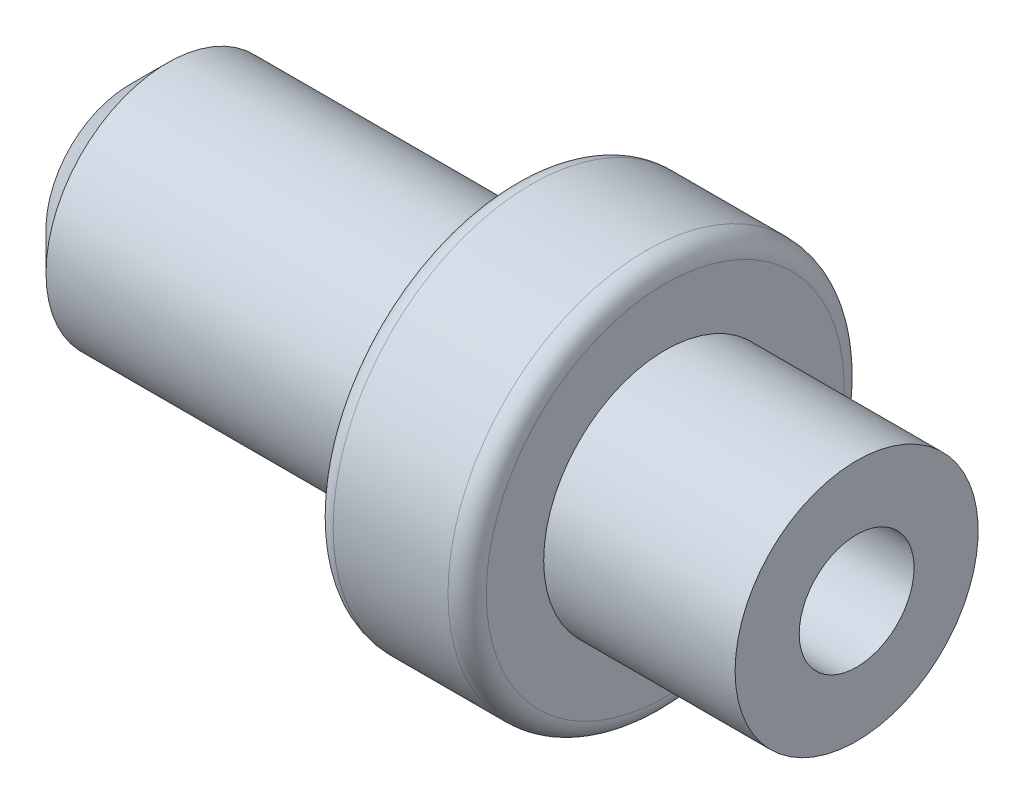
ISO-10303-21;
HEADER;
FILE_DESCRIPTION(('STEP AP214'),'2;1');
FILE_NAME('part.step','',(''),(''),'','','');
FILE_SCHEMA(('AUTOMOTIVE_DESIGN { 1 0 10303 214 1 1 1 1 }'));
ENDSEC;
DATA;
#1=APPLICATION_CONTEXT('core data for automotive mechanical design processes');
#2=APPLICATION_PROTOCOL_DEFINITION('international standard','automotive_design',2000,#1);
#3=PRODUCT_CONTEXT('',#1,'mechanical');
#4=PRODUCT('Part','Part','',(#3));
#5=PRODUCT_RELATED_PRODUCT_CATEGORY('part','',(#4));
#6=PRODUCT_DEFINITION_FORMATION('','',#4);
#7=PRODUCT_DEFINITION_CONTEXT('part definition',#1,'design');
#8=PRODUCT_DEFINITION('design','',#6,#7);
#9=PRODUCT_DEFINITION_SHAPE('','',#8);
#10=(LENGTH_UNIT() NAMED_UNIT(*) SI_UNIT(.MILLI.,.METRE.));
#11=(NAMED_UNIT(*) PLANE_ANGLE_UNIT() SI_UNIT($,.RADIAN.));
#12=(NAMED_UNIT(*) SI_UNIT($,.STERADIAN.) SOLID_ANGLE_UNIT());
#13=UNCERTAINTY_MEASURE_WITH_UNIT(LENGTH_MEASURE(1.E-05),#10,'distance_accuracy_value','');
#14=(GEOMETRIC_REPRESENTATION_CONTEXT(3) GLOBAL_UNCERTAINTY_ASSIGNED_CONTEXT((#13)) GLOBAL_UNIT_ASSIGNED_CONTEXT((#10,
#11,#12)) REPRESENTATION_CONTEXT('',''));
#15=CARTESIAN_POINT('',(0.,0.,0.));
#16=DIRECTION('',(0.,0.,1.));
#17=DIRECTION('',(1.,0.,0.));
#18=AXIS2_PLACEMENT_3D('',#15,#16,#17);
#19=CARTESIAN_POINT('',(-34.8243596228253,0.,0.));
#20=DIRECTION('',(-1.,0.,0.));
#21=DIRECTION('',(0.,0.,1.));
#22=AXIS2_PLACEMENT_3D('',#19,#20,#21);
#23=CYLINDRICAL_SURFACE('',#22,3.175);
#24=CARTESIAN_POINT('',(-8.99999999999999,0.,0.));
#25=DIRECTION('',(1.,0.,0.));
#26=DIRECTION('',(0.,0.,-1.));
#27=AXIS2_PLACEMENT_3D('',#24,#25,#26);
#28=CIRCLE('',#27,3.175);
#29=CARTESIAN_POINT('',(-8.99999999999999,0.,-3.175));
#30=VERTEX_POINT('',#29);
#31=EDGE_CURVE('E49',#30,#30,#28,.T.);
#32=ORIENTED_EDGE('',*,*,#31,.T.);
#33=EDGE_LOOP('',(#32));
#34=FACE_BOUND('',#33,.T.);
#35=CARTESIAN_POINT('',(0.,0.,0.));
#36=DIRECTION('',(-1.,0.,0.));
#37=DIRECTION('',(0.,0.,1.));
#38=AXIS2_PLACEMENT_3D('',#35,#36,#37);
#39=CIRCLE('',#38,3.175);
#40=CARTESIAN_POINT('',(0.,0.,3.175));
#41=VERTEX_POINT('',#40);
#42=EDGE_CURVE('E67',#41,#41,#39,.T.);
#43=ORIENTED_EDGE('',*,*,#42,.T.);
#44=EDGE_LOOP('',(#43));
#45=FACE_BOUND('',#44,.T.);
#46=ADVANCED_FACE('F29',(#34,#45),#23,.T.);
#47=CARTESIAN_POINT('',(-10.,1.5,0.));
#48=DIRECTION('',(1.,0.,0.));
#49=DIRECTION('',(0.,0.,-1.));
#50=AXIS2_PLACEMENT_3D('',#47,#48,#49);
#51=PLANE('',#50);
#52=CARTESIAN_POINT('',(-10.,0.,0.));
#53=DIRECTION('',(1.,0.,0.));
#54=DIRECTION('',(0.,0.,-1.));
#55=AXIS2_PLACEMENT_3D('',#52,#53,#54);
#56=CIRCLE('',#55,2.175);
#57=CARTESIAN_POINT('',(-10.,0.,-2.175));
#58=VERTEX_POINT('',#57);
#59=EDGE_CURVE('E52',#58,#58,#56,.F.);
#60=ORIENTED_EDGE('',*,*,#59,.T.);
#61=EDGE_LOOP('',(#60));
#62=FACE_BOUND('',#61,.T.);
#63=CARTESIAN_POINT('',(-10.,0.,0.));
#64=DIRECTION('',(-1.,0.,0.));
#65=DIRECTION('',(0.,0.,1.));
#66=AXIS2_PLACEMENT_3D('',#63,#64,#65);
#67=CIRCLE('',#66,1.5);
#68=CARTESIAN_POINT('',(-10.,0.,1.5));
#69=VERTEX_POINT('',#68);
#70=EDGE_CURVE('E55',#69,#69,#67,.T.);
#71=ORIENTED_EDGE('',*,*,#70,.F.);
#72=EDGE_LOOP('',(#71));
#73=FACE_BOUND('',#72,.T.);
#74=ADVANCED_FACE('F88',(#62,#73),#51,.F.);
#75=CARTESIAN_POINT('',(-34.8243596228253,0.,0.));
#76=DIRECTION('',(-1.,0.,0.));
#77=DIRECTION('',(0.,0.,1.));
#78=AXIS2_PLACEMENT_3D('',#75,#76,#77);
#79=CYLINDRICAL_SURFACE('',#78,1.5);
#80=CARTESIAN_POINT('',(9.,0.,0.));
#81=DIRECTION('',(-1.,0.,0.));
#82=DIRECTION('',(0.,0.,1.));
#83=AXIS2_PLACEMENT_3D('',#80,#81,#82);
#84=CIRCLE('',#83,1.5);
#85=CARTESIAN_POINT('',(9.,0.,1.5));
#86=VERTEX_POINT('',#85);
#87=EDGE_CURVE('E58',#86,#86,#84,.T.);
#88=ORIENTED_EDGE('',*,*,#87,.F.);
#89=EDGE_LOOP('',(#88));
#90=FACE_BOUND('',#89,.T.);
#91=ORIENTED_EDGE('',*,*,#70,.T.);
#92=EDGE_LOOP('',(#91));
#93=FACE_BOUND('',#92,.T.);
#94=ADVANCED_FACE('F94',(#90,#93),#79,.F.);
#95=CARTESIAN_POINT('',(9.,3.175,0.));
#96=DIRECTION('',(-1.,0.,0.));
#97=DIRECTION('',(0.,0.,1.));
#98=AXIS2_PLACEMENT_3D('',#95,#96,#97);
#99=PLANE('',#98);
#100=CARTESIAN_POINT('',(9.,0.,0.));
#101=DIRECTION('',(-1.,0.,0.));
#102=DIRECTION('',(0.,0.,1.));
#103=AXIS2_PLACEMENT_3D('',#100,#101,#102);
#104=CIRCLE('',#103,3.175);
#105=CARTESIAN_POINT('',(9.,0.,3.175));
#106=VERTEX_POINT('',#105);
#107=EDGE_CURVE('E61',#106,#106,#104,.T.);
#108=ORIENTED_EDGE('',*,*,#107,.F.);
#109=EDGE_LOOP('',(#108));
#110=FACE_BOUND('',#109,.T.);
#111=ORIENTED_EDGE('',*,*,#87,.T.);
#112=EDGE_LOOP('',(#111));
#113=FACE_BOUND('',#112,.T.);
#114=ADVANCED_FACE('F161',(#110,#113),#99,.F.);
#115=CARTESIAN_POINT('',(-34.8243596228253,0.,0.));
#116=DIRECTION('',(-1.,0.,0.));
#117=DIRECTION('',(0.,0.,1.));
#118=AXIS2_PLACEMENT_3D('',#115,#116,#117);
#119=CYLINDRICAL_SURFACE('',#118,3.175);
#120=CARTESIAN_POINT('',(4.,0.,0.));
#121=DIRECTION('',(-1.,0.,0.));
#122=DIRECTION('',(0.,0.,1.));
#123=AXIS2_PLACEMENT_3D('',#120,#121,#122);
#124=CIRCLE('',#123,3.175);
#125=CARTESIAN_POINT('',(4.,0.,3.175));
#126=VERTEX_POINT('',#125);
#127=EDGE_CURVE('E64',#126,#126,#124,.T.);
#128=ORIENTED_EDGE('',*,*,#127,.F.);
#129=EDGE_LOOP('',(#128));
#130=FACE_BOUND('',#129,.T.);
#131=ORIENTED_EDGE('',*,*,#107,.T.);
#132=EDGE_LOOP('',(#131));
#133=FACE_BOUND('',#132,.T.);
#134=ADVANCED_FACE('F135',(#130,#133),#119,.T.);
#135=CARTESIAN_POINT('',(4.,5.175,0.));
#136=DIRECTION('',(-1.,0.,0.));
#137=DIRECTION('',(0.,0.,1.));
#138=AXIS2_PLACEMENT_3D('',#135,#136,#137);
#139=PLANE('',#138);
#140=CARTESIAN_POINT('',(4.,0.,0.));
#141=DIRECTION('',(-1.,0.,0.));
#142=DIRECTION('',(0.,0.,1.));
#143=AXIS2_PLACEMENT_3D('',#140,#141,#142);
#144=CIRCLE('',#143,4.675);
#145=CARTESIAN_POINT('',(4.,0.,4.675));
#146=VERTEX_POINT('',#145);
#147=EDGE_CURVE('E36',#146,#146,#144,.F.);
#148=ORIENTED_EDGE('',*,*,#147,.T.);
#149=EDGE_LOOP('',(#148));
#150=FACE_BOUND('',#149,.T.);
#151=ORIENTED_EDGE('',*,*,#127,.T.);
#152=EDGE_LOOP('',(#151));
#153=FACE_BOUND('',#152,.T.);
#154=ADVANCED_FACE('F84',(#150,#153),#139,.F.);
#155=CARTESIAN_POINT('',(-34.8243596228253,0.,0.));
#156=DIRECTION('',(-1.,0.,0.));
#157=DIRECTION('',(0.,0.,1.));
#158=AXIS2_PLACEMENT_3D('',#155,#156,#157);
#159=CYLINDRICAL_SURFACE('',#158,5.175);
#160=CARTESIAN_POINT('',(3.5,0.,0.));
#161=DIRECTION('',(-1.,0.,0.));
#162=DIRECTION('',(0.,0.,1.));
#163=AXIS2_PLACEMENT_3D('',#160,#161,#162);
#164=CIRCLE('',#163,5.175);
#165=CARTESIAN_POINT('',(3.5,0.,5.175));
#166=VERTEX_POINT('',#165);
#167=EDGE_CURVE('E40',#166,#166,#164,.T.);
#168=ORIENTED_EDGE('',*,*,#167,.T.);
#169=EDGE_LOOP('',(#168));
#170=FACE_BOUND('',#169,.T.);
#171=CARTESIAN_POINT('',(0.5,0.,0.));
#172=DIRECTION('',(1.,0.,0.));
#173=DIRECTION('',(0.,0.,-1.));
#174=AXIS2_PLACEMENT_3D('',#171,#172,#173);
#175=CIRCLE('',#174,5.175);
#176=CARTESIAN_POINT('',(0.5,0.,-5.175));
#177=VERTEX_POINT('',#176);
#178=EDGE_CURVE('E44',#177,#177,#175,.T.);
#179=ORIENTED_EDGE('',*,*,#178,.T.);
#180=EDGE_LOOP('',(#179));
#181=FACE_BOUND('',#180,.T.);
#182=ADVANCED_FACE('F75',(#170,#181),#159,.T.);
#183=CARTESIAN_POINT('',(0.,3.175,0.));
#184=DIRECTION('',(1.,0.,0.));
#185=DIRECTION('',(0.,0.,-1.));
#186=AXIS2_PLACEMENT_3D('',#183,#184,#185);
#187=PLANE('',#186);
#188=CARTESIAN_POINT('',(0.,0.,0.));
#189=DIRECTION('',(1.,0.,0.));
#190=DIRECTION('',(0.,0.,-1.));
#191=AXIS2_PLACEMENT_3D('',#188,#189,#190);
#192=CIRCLE('',#191,4.675);
#193=CARTESIAN_POINT('',(0.,0.,-4.675));
#194=VERTEX_POINT('',#193);
#195=EDGE_CURVE('E10',#194,#194,#192,.F.);
#196=ORIENTED_EDGE('',*,*,#195,.T.);
#197=EDGE_LOOP('',(#196));
#198=FACE_BOUND('',#197,.T.);
#199=ORIENTED_EDGE('',*,*,#42,.F.);
#200=EDGE_LOOP('',(#199));
#201=FACE_BOUND('',#200,.T.);
#202=ADVANCED_FACE('F72',(#198,#201),#187,.F.);
#203=CARTESIAN_POINT('',(-10.,0.,0.));
#204=DIRECTION('',(1.,0.,0.));
#205=DIRECTION('',(0.,0.,-1.));
#206=AXIS2_PLACEMENT_3D('',#203,#204,#205);
#207=CONICAL_SURFACE('',#206,2.175,0.785398163397446);
#208=ORIENTED_EDGE('',*,*,#31,.F.);
#209=EDGE_LOOP('',(#208));
#210=FACE_BOUND('',#209,.T.);
#211=ORIENTED_EDGE('',*,*,#59,.F.);
#212=EDGE_LOOP('',(#211));
#213=FACE_BOUND('',#212,.T.);
#214=ADVANCED_FACE('F74',(#210,#213),#207,.T.);
#215=CARTESIAN_POINT('',(3.5,0.,0.));
#216=DIRECTION('',(-1.,0.,0.));
#217=DIRECTION('',(0.,0.,1.));
#218=AXIS2_PLACEMENT_3D('',#215,#216,#217);
#219=TOROIDAL_SURFACE('',#218,4.675,0.5);
#220=ORIENTED_EDGE('',*,*,#147,.F.);
#221=EDGE_LOOP('',(#220));
#222=FACE_BOUND('',#221,.T.);
#223=ORIENTED_EDGE('',*,*,#167,.F.);
#224=EDGE_LOOP('',(#223));
#225=FACE_BOUND('',#224,.T.);
#226=ADVANCED_FACE('F81',(#222,#225),#219,.T.);
#227=CARTESIAN_POINT('',(0.5,0.,0.));
#228=DIRECTION('',(1.,0.,0.));
#229=DIRECTION('',(0.,0.,-1.));
#230=AXIS2_PLACEMENT_3D('',#227,#228,#229);
#231=TOROIDAL_SURFACE('',#230,4.675,0.5);
#232=ORIENTED_EDGE('',*,*,#178,.F.);
#233=EDGE_LOOP('',(#232));
#234=FACE_BOUND('',#233,.T.);
#235=ORIENTED_EDGE('',*,*,#195,.F.);
#236=EDGE_LOOP('',(#235));
#237=FACE_BOUND('',#236,.T.);
#238=ADVANCED_FACE('F31',(#234,#237),#231,.T.);
#239=CLOSED_SHELL('',(#46,#74,#94,#114,#134,#154,#182,#202,#214,#226,#238));
#240=MANIFOLD_SOLID_BREP('B2',#239);
#241=ADVANCED_BREP_SHAPE_REPRESENTATION('',(#18,#240),#14);
#242=SHAPE_DEFINITION_REPRESENTATION(#9,#241);
ENDSEC;
END-ISO-10303-21;
